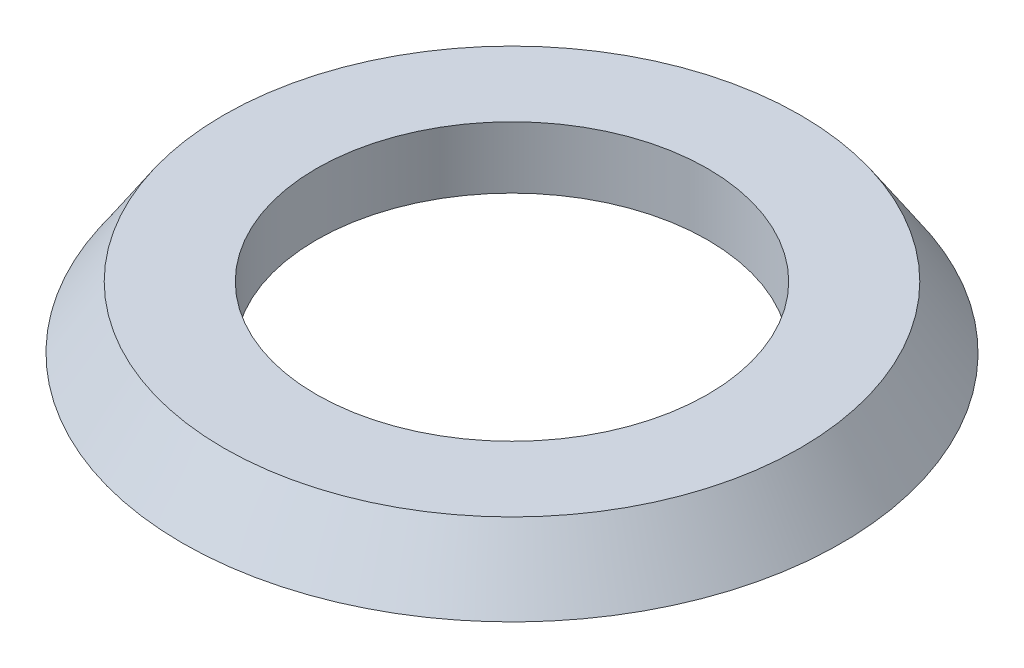
ISO-10303-21;
HEADER;
FILE_DESCRIPTION(('STEP AP214'),'2;1');
FILE_NAME('part.step','',(''),(''),'','','');
FILE_SCHEMA(('AUTOMOTIVE_DESIGN { 1 0 10303 214 1 1 1 1 }'));
ENDSEC;
DATA;
#1=APPLICATION_CONTEXT('core data for automotive mechanical design processes');
#2=APPLICATION_PROTOCOL_DEFINITION('international standard','automotive_design',2000,#1);
#3=PRODUCT_CONTEXT('',#1,'mechanical');
#4=PRODUCT('Part','Part','',(#3));
#5=PRODUCT_RELATED_PRODUCT_CATEGORY('part','',(#4));
#6=PRODUCT_DEFINITION_FORMATION('','',#4);
#7=PRODUCT_DEFINITION_CONTEXT('part definition',#1,'design');
#8=PRODUCT_DEFINITION('design','',#6,#7);
#9=PRODUCT_DEFINITION_SHAPE('','',#8);
#10=(LENGTH_UNIT() NAMED_UNIT(*) SI_UNIT(.MILLI.,.METRE.));
#11=(NAMED_UNIT(*) PLANE_ANGLE_UNIT() SI_UNIT($,.RADIAN.));
#12=(NAMED_UNIT(*) SI_UNIT($,.STERADIAN.) SOLID_ANGLE_UNIT());
#13=UNCERTAINTY_MEASURE_WITH_UNIT(LENGTH_MEASURE(1.E-05),#10,'distance_accuracy_value','');
#14=(GEOMETRIC_REPRESENTATION_CONTEXT(3) GLOBAL_UNCERTAINTY_ASSIGNED_CONTEXT((#13)) GLOBAL_UNIT_ASSIGNED_CONTEXT((#10,
#11,#12)) REPRESENTATION_CONTEXT('',''));
#15=CARTESIAN_POINT('',(0.,0.,0.));
#16=DIRECTION('',(0.,0.,1.));
#17=DIRECTION('',(1.,0.,0.));
#18=AXIS2_PLACEMENT_3D('',#15,#16,#17);
#19=CARTESIAN_POINT('',(0.,0.,0.));
#20=DIRECTION('',(0.,-1.,0.));
#21=DIRECTION('',(0.,0.,-1.));
#22=AXIS2_PLACEMENT_3D('',#19,#20,#21);
#23=PLANE('',#22);
#24=CARTESIAN_POINT('',(0.,0.,0.));
#25=DIRECTION('',(0.,-1.,0.));
#26=DIRECTION('',(0.,0.,-1.));
#27=AXIS2_PLACEMENT_3D('',#24,#25,#26);
#28=CIRCLE('',#27,9.5);
#29=CARTESIAN_POINT('',(0.,0.,-9.5));
#30=VERTEX_POINT('',#29);
#31=EDGE_CURVE('E44',#30,#30,#28,.T.);
#32=ORIENTED_EDGE('',*,*,#31,.F.);
#33=EDGE_LOOP('',(#32));
#34=FACE_BOUND('',#33,.T.);
#35=CARTESIAN_POINT('',(0.,0.,0.));
#36=DIRECTION('',(0.,-1.,0.));
#37=DIRECTION('',(0.,0.,-1.));
#38=AXIS2_PLACEMENT_3D('',#35,#36,#37);
#39=CIRCLE('',#38,16.);
#40=CARTESIAN_POINT('',(0.,0.,-16.));
#41=VERTEX_POINT('',#40);
#42=EDGE_CURVE('E10',#41,#41,#39,.T.);
#43=ORIENTED_EDGE('',*,*,#42,.T.);
#44=EDGE_LOOP('',(#43));
#45=FACE_BOUND('',#44,.T.);
#46=ADVANCED_FACE('F34',(#34,#45),#23,.T.);
#47=CARTESIAN_POINT('',(0.,0.,0.));
#48=DIRECTION('',(0.,-1.,0.));
#49=DIRECTION('',(0.,0.,-1.));
#50=AXIS2_PLACEMENT_3D('',#47,#48,#49);
#51=CONICAL_SURFACE('',#50,16.,0.588002603547568);
#52=CARTESIAN_POINT('',(0.,3.,0.));
#53=DIRECTION('',(0.,-1.,0.));
#54=DIRECTION('',(0.,0.,-1.));
#55=AXIS2_PLACEMENT_3D('',#52,#53,#54);
#56=CIRCLE('',#55,14.);
#57=CARTESIAN_POINT('',(0.,3.,-14.));
#58=VERTEX_POINT('',#57);
#59=EDGE_CURVE('E40',#58,#58,#56,.T.);
#60=ORIENTED_EDGE('',*,*,#59,.T.);
#61=EDGE_LOOP('',(#60));
#62=FACE_BOUND('',#61,.T.);
#63=ORIENTED_EDGE('',*,*,#42,.F.);
#64=EDGE_LOOP('',(#63));
#65=FACE_BOUND('',#64,.T.);
#66=ADVANCED_FACE('F59',(#62,#65),#51,.T.);
#67=CARTESIAN_POINT('',(0.,3.,0.));
#68=DIRECTION('',(0.,1.,0.));
#69=DIRECTION('',(0.,0.,1.));
#70=AXIS2_PLACEMENT_3D('',#67,#68,#69);
#71=PLANE('',#70);
#72=CARTESIAN_POINT('',(0.,3.,0.));
#73=DIRECTION('',(0.,1.,0.));
#74=DIRECTION('',(0.,0.,1.));
#75=AXIS2_PLACEMENT_3D('',#72,#73,#74);
#76=CIRCLE('',#75,9.5);
#77=CARTESIAN_POINT('',(0.,3.,9.5));
#78=VERTEX_POINT('',#77);
#79=EDGE_CURVE('E48',#78,#78,#76,.T.);
#80=ORIENTED_EDGE('',*,*,#79,.F.);
#81=EDGE_LOOP('',(#80));
#82=FACE_BOUND('',#81,.T.);
#83=ORIENTED_EDGE('',*,*,#59,.F.);
#84=EDGE_LOOP('',(#83));
#85=FACE_BOUND('',#84,.T.);
#86=ADVANCED_FACE('F56',(#82,#85),#71,.T.);
#87=CARTESIAN_POINT('',(0.,-7.,0.));
#88=DIRECTION('',(0.,1.,0.));
#89=DIRECTION('',(0.,0.,1.));
#90=AXIS2_PLACEMENT_3D('',#87,#88,#89);
#91=CYLINDRICAL_SURFACE('',#90,9.5);
#92=ORIENTED_EDGE('',*,*,#31,.T.);
#93=EDGE_LOOP('',(#92));
#94=FACE_BOUND('',#93,.T.);
#95=ORIENTED_EDGE('',*,*,#79,.T.);
#96=EDGE_LOOP('',(#95));
#97=FACE_BOUND('',#96,.T.);
#98=ADVANCED_FACE('F54',(#94,#97),#91,.F.);
#99=CLOSED_SHELL('',(#46,#66,#86,#98));
#100=MANIFOLD_SOLID_BREP('B2',#99);
#101=ADVANCED_BREP_SHAPE_REPRESENTATION('',(#18,#100),#14);
#102=SHAPE_DEFINITION_REPRESENTATION(#9,#101);
ENDSEC;
END-ISO-10303-21;
